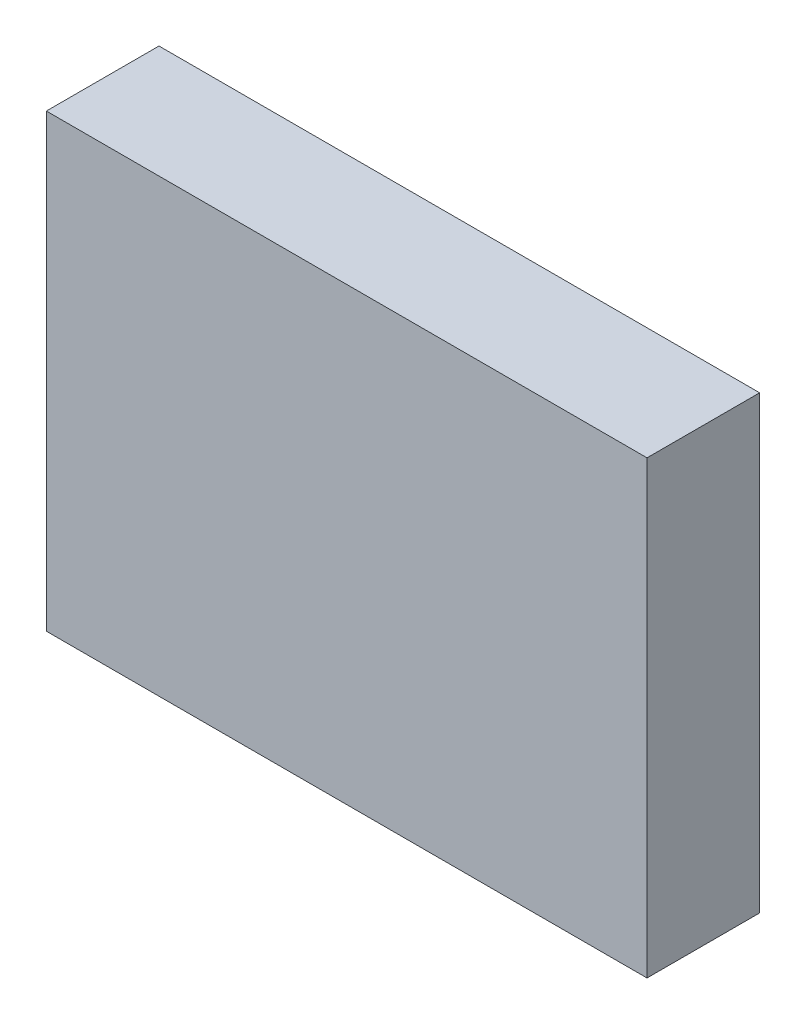
ISO-10303-21;
HEADER;
FILE_DESCRIPTION(('STEP AP214'),'2;1');
FILE_NAME('part.step','',(''),(''),'','','');
FILE_SCHEMA(('AUTOMOTIVE_DESIGN { 1 0 10303 214 1 1 1 1 }'));
ENDSEC;
DATA;
#1=APPLICATION_CONTEXT('core data for automotive mechanical design processes');
#2=APPLICATION_PROTOCOL_DEFINITION('international standard','automotive_design',2000,#1);
#3=PRODUCT_CONTEXT('',#1,'mechanical');
#4=PRODUCT('Part','Part','',(#3));
#5=PRODUCT_RELATED_PRODUCT_CATEGORY('part','',(#4));
#6=PRODUCT_DEFINITION_FORMATION('','',#4);
#7=PRODUCT_DEFINITION_CONTEXT('part definition',#1,'design');
#8=PRODUCT_DEFINITION('design','',#6,#7);
#9=PRODUCT_DEFINITION_SHAPE('','',#8);
#10=(LENGTH_UNIT() NAMED_UNIT(*) SI_UNIT(.MILLI.,.METRE.));
#11=(NAMED_UNIT(*) PLANE_ANGLE_UNIT() SI_UNIT($,.RADIAN.));
#12=(NAMED_UNIT(*) SI_UNIT($,.STERADIAN.) SOLID_ANGLE_UNIT());
#13=UNCERTAINTY_MEASURE_WITH_UNIT(LENGTH_MEASURE(1.E-05),#10,'distance_accuracy_value','');
#14=(GEOMETRIC_REPRESENTATION_CONTEXT(3) GLOBAL_UNCERTAINTY_ASSIGNED_CONTEXT((#13)) GLOBAL_UNIT_ASSIGNED_CONTEXT((#10,
#11,#12)) REPRESENTATION_CONTEXT('',''));
#15=CARTESIAN_POINT('',(0.,0.,0.));
#16=DIRECTION('',(0.,0.,1.));
#17=DIRECTION('',(1.,0.,0.));
#18=AXIS2_PLACEMENT_3D('',#15,#16,#17);
#19=CARTESIAN_POINT('',(-16.,12.,6.));
#20=DIRECTION('',(1.,0.,0.));
#21=DIRECTION('',(0.,0.,-1.));
#22=AXIS2_PLACEMENT_3D('',#19,#20,#21);
#23=PLANE('',#22);
#24=DIRECTION('',(0.,-1.,0.));
#25=VECTOR('',#24,1.);
#26=CARTESIAN_POINT('',(-16.,12.,0.));
#27=LINE('',#26,#25);
#28=CARTESIAN_POINT('',(-16.,12.,0.));
#29=VERTEX_POINT('',#28);
#30=CARTESIAN_POINT('',(-16.,-12.,0.));
#31=VERTEX_POINT('',#30);
#32=EDGE_CURVE('E98',#29,#31,#27,.T.);
#33=ORIENTED_EDGE('',*,*,#32,.T.);
#34=DIRECTION('',(0.,0.,-1.));
#35=VECTOR('',#34,1.);
#36=CARTESIAN_POINT('',(-16.,-12.,6.));
#37=LINE('',#36,#35);
#38=CARTESIAN_POINT('',(-16.,-12.,6.));
#39=VERTEX_POINT('',#38);
#40=EDGE_CURVE('E11',#39,#31,#37,.T.);
#41=ORIENTED_EDGE('',*,*,#40,.F.);
#42=DIRECTION('',(0.,-1.,0.));
#43=VECTOR('',#42,1.);
#44=CARTESIAN_POINT('',(-16.,12.,6.));
#45=LINE('',#44,#43);
#46=CARTESIAN_POINT('',(-16.,12.,6.));
#47=VERTEX_POINT('',#46);
#48=EDGE_CURVE('E86',#47,#39,#45,.T.);
#49=ORIENTED_EDGE('',*,*,#48,.F.);
#50=DIRECTION('',(0.,0.,-1.));
#51=VECTOR('',#50,1.);
#52=CARTESIAN_POINT('',(-16.,12.,6.));
#53=LINE('',#52,#51);
#54=EDGE_CURVE('E94',#47,#29,#53,.T.);
#55=ORIENTED_EDGE('',*,*,#54,.T.);
#56=EDGE_LOOP('',(#33,#41,#49,#55));
#57=FACE_BOUND('',#56,.T.);
#58=ADVANCED_FACE('F35',(#57),#23,.F.);
#59=CARTESIAN_POINT('',(16.,-12.,6.));
#60=DIRECTION('',(0.,1.,0.));
#61=DIRECTION('',(0.,0.,1.));
#62=AXIS2_PLACEMENT_3D('',#59,#60,#61);
#63=PLANE('',#62);
#64=DIRECTION('',(1.,0.,0.));
#65=VECTOR('',#64,1.);
#66=CARTESIAN_POINT('',(16.,-12.,0.));
#67=LINE('',#66,#65);
#68=CARTESIAN_POINT('',(16.,-12.,0.));
#69=VERTEX_POINT('',#68);
#70=EDGE_CURVE('E90',#31,#69,#67,.T.);
#71=ORIENTED_EDGE('',*,*,#70,.T.);
#72=DIRECTION('',(0.,0.,-1.));
#73=VECTOR('',#72,1.);
#74=CARTESIAN_POINT('',(16.,-12.,6.));
#75=LINE('',#74,#73);
#76=CARTESIAN_POINT('',(16.,-12.,6.));
#77=VERTEX_POINT('',#76);
#78=EDGE_CURVE('E43',#77,#69,#75,.T.);
#79=ORIENTED_EDGE('',*,*,#78,.F.);
#80=DIRECTION('',(1.,0.,0.));
#81=VECTOR('',#80,1.);
#82=CARTESIAN_POINT('',(16.,-12.,6.));
#83=LINE('',#82,#81);
#84=EDGE_CURVE('E81',#39,#77,#83,.T.);
#85=ORIENTED_EDGE('',*,*,#84,.F.);
#86=ORIENTED_EDGE('',*,*,#40,.T.);
#87=EDGE_LOOP('',(#71,#79,#85,#86));
#88=FACE_BOUND('',#87,.T.);
#89=ADVANCED_FACE('F89',(#88),#63,.F.);
#90=CARTESIAN_POINT('',(16.,12.,6.));
#91=DIRECTION('',(-1.,0.,0.));
#92=DIRECTION('',(0.,0.,1.));
#93=AXIS2_PLACEMENT_3D('',#90,#91,#92);
#94=PLANE('',#93);
#95=DIRECTION('',(0.,1.,0.));
#96=VECTOR('',#95,1.);
#97=CARTESIAN_POINT('',(16.,12.,0.));
#98=LINE('',#97,#96);
#99=CARTESIAN_POINT('',(16.,12.,0.));
#100=VERTEX_POINT('',#99);
#101=EDGE_CURVE('E68',#69,#100,#98,.T.);
#102=ORIENTED_EDGE('',*,*,#101,.T.);
#103=DIRECTION('',(0.,0.,-1.));
#104=VECTOR('',#103,1.);
#105=CARTESIAN_POINT('',(16.,12.,6.));
#106=LINE('',#105,#104);
#107=CARTESIAN_POINT('',(16.,12.,6.));
#108=VERTEX_POINT('',#107);
#109=EDGE_CURVE('E91',#108,#100,#106,.T.);
#110=ORIENTED_EDGE('',*,*,#109,.F.);
#111=DIRECTION('',(0.,1.,0.));
#112=VECTOR('',#111,1.);
#113=CARTESIAN_POINT('',(16.,12.,6.));
#114=LINE('',#113,#112);
#115=EDGE_CURVE('E84',#77,#108,#114,.T.);
#116=ORIENTED_EDGE('',*,*,#115,.F.);
#117=ORIENTED_EDGE('',*,*,#78,.T.);
#118=EDGE_LOOP('',(#102,#110,#116,#117));
#119=FACE_BOUND('',#118,.T.);
#120=ADVANCED_FACE('F92',(#119),#94,.F.);
#121=CARTESIAN_POINT('',(16.,12.,6.));
#122=DIRECTION('',(0.,-1.,0.));
#123=DIRECTION('',(0.,0.,-1.));
#124=AXIS2_PLACEMENT_3D('',#121,#122,#123);
#125=PLANE('',#124);
#126=DIRECTION('',(-1.,0.,0.));
#127=VECTOR('',#126,1.);
#128=CARTESIAN_POINT('',(16.,12.,0.));
#129=LINE('',#128,#127);
#130=EDGE_CURVE('E74',#100,#29,#129,.T.);
#131=ORIENTED_EDGE('',*,*,#130,.T.);
#132=ORIENTED_EDGE('',*,*,#54,.F.);
#133=DIRECTION('',(-1.,0.,0.));
#134=VECTOR('',#133,1.);
#135=CARTESIAN_POINT('',(16.,12.,6.));
#136=LINE('',#135,#134);
#137=EDGE_CURVE('E51',#108,#47,#136,.T.);
#138=ORIENTED_EDGE('',*,*,#137,.F.);
#139=ORIENTED_EDGE('',*,*,#109,.T.);
#140=EDGE_LOOP('',(#131,#132,#138,#139));
#141=FACE_BOUND('',#140,.T.);
#142=ADVANCED_FACE('F105',(#141),#125,.F.);
#143=CARTESIAN_POINT('',(0.,0.,6.));
#144=DIRECTION('',(0.,0.,-1.));
#145=DIRECTION('',(-1.,0.,0.));
#146=AXIS2_PLACEMENT_3D('',#143,#144,#145);
#147=PLANE('',#146);
#148=ORIENTED_EDGE('',*,*,#48,.T.);
#149=ORIENTED_EDGE('',*,*,#84,.T.);
#150=ORIENTED_EDGE('',*,*,#115,.T.);
#151=ORIENTED_EDGE('',*,*,#137,.T.);
#152=EDGE_LOOP('',(#148,#149,#150,#151));
#153=FACE_BOUND('',#152,.T.);
#154=ADVANCED_FACE('F82',(#153),#147,.F.);
#155=CARTESIAN_POINT('',(0.,0.,0.));
#156=DIRECTION('',(0.,0.,-1.));
#157=DIRECTION('',(-1.,0.,0.));
#158=AXIS2_PLACEMENT_3D('',#155,#156,#157);
#159=PLANE('',#158);
#160=ORIENTED_EDGE('',*,*,#32,.F.);
#161=ORIENTED_EDGE('',*,*,#130,.F.);
#162=ORIENTED_EDGE('',*,*,#101,.F.);
#163=ORIENTED_EDGE('',*,*,#70,.F.);
#164=EDGE_LOOP('',(#160,#161,#162,#163));
#165=FACE_BOUND('',#164,.T.);
#166=ADVANCED_FACE('F108',(#165),#159,.T.);
#167=CLOSED_SHELL('',(#58,#89,#120,#142,#154,#166));
#168=MANIFOLD_SOLID_BREP('B2',#167);
#169=ADVANCED_BREP_SHAPE_REPRESENTATION('',(#18,#168),#14);
#170=SHAPE_DEFINITION_REPRESENTATION(#9,#169);
ENDSEC;
END-ISO-10303-21;
